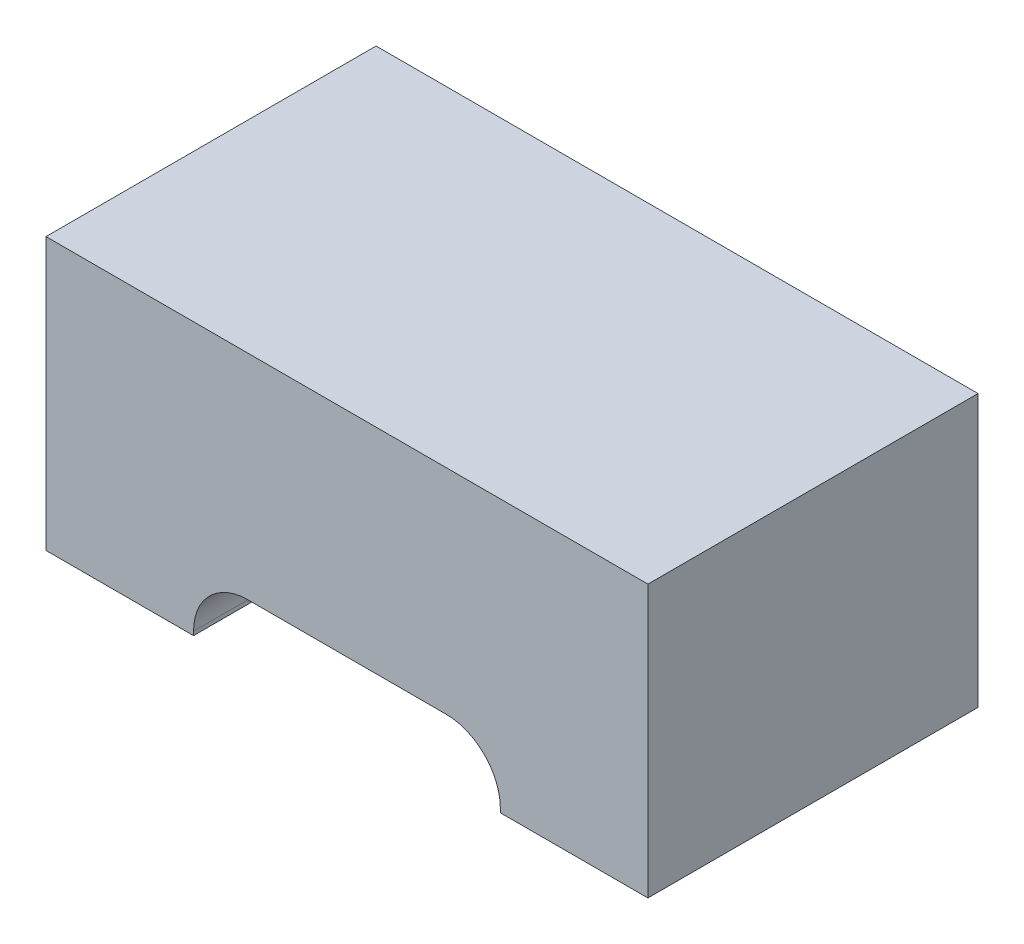
ISO-10303-21;
HEADER;
FILE_DESCRIPTION(('STEP AP214'),'2;1');
FILE_NAME('part.step','',(''),(''),'','','');
FILE_SCHEMA(('AUTOMOTIVE_DESIGN { 1 0 10303 214 1 1 1 1 }'));
ENDSEC;
DATA;
#1=APPLICATION_CONTEXT('core data for automotive mechanical design processes');
#2=APPLICATION_PROTOCOL_DEFINITION('international standard','automotive_design',2000,#1);
#3=PRODUCT_CONTEXT('',#1,'mechanical');
#4=PRODUCT('Part','Part','',(#3));
#5=PRODUCT_RELATED_PRODUCT_CATEGORY('part','',(#4));
#6=PRODUCT_DEFINITION_FORMATION('','',#4);
#7=PRODUCT_DEFINITION_CONTEXT('part definition',#1,'design');
#8=PRODUCT_DEFINITION('design','',#6,#7);
#9=PRODUCT_DEFINITION_SHAPE('','',#8);
#10=(LENGTH_UNIT() NAMED_UNIT(*) SI_UNIT(.MILLI.,.METRE.));
#11=(NAMED_UNIT(*) PLANE_ANGLE_UNIT() SI_UNIT($,.RADIAN.));
#12=(NAMED_UNIT(*) SI_UNIT($,.STERADIAN.) SOLID_ANGLE_UNIT());
#13=UNCERTAINTY_MEASURE_WITH_UNIT(LENGTH_MEASURE(1.E-05),#10,'distance_accuracy_value','');
#14=(GEOMETRIC_REPRESENTATION_CONTEXT(3) GLOBAL_UNCERTAINTY_ASSIGNED_CONTEXT((#13)) GLOBAL_UNIT_ASSIGNED_CONTEXT((#10,
#11,#12)) REPRESENTATION_CONTEXT('',''));
#15=CARTESIAN_POINT('',(0.,0.,0.));
#16=DIRECTION('',(0.,0.,1.));
#17=DIRECTION('',(1.,0.,0.));
#18=AXIS2_PLACEMENT_3D('',#15,#16,#17);
#19=CARTESIAN_POINT('',(0.,0.,0.));
#20=DIRECTION('',(0.,-1.,0.));
#21=DIRECTION('',(0.,0.,-1.));
#22=AXIS2_PLACEMENT_3D('',#19,#20,#21);
#23=PLANE('',#22);
#24=DIRECTION('',(0.,0.,1.));
#25=VECTOR('',#24,1.);
#26=CARTESIAN_POINT('',(0.395,0.,-0.425));
#27=LINE('',#26,#25);
#28=CARTESIAN_POINT('',(0.395,0.,-0.425));
#29=VERTEX_POINT('',#28);
#30=CARTESIAN_POINT('',(0.395,0.,0.425));
#31=VERTEX_POINT('',#30);
#32=EDGE_CURVE('E137',#29,#31,#27,.T.);
#33=ORIENTED_EDGE('',*,*,#32,.F.);
#34=DIRECTION('',(-1.,0.,0.));
#35=VECTOR('',#34,1.);
#36=CARTESIAN_POINT('',(-0.775,0.,-0.425));
#37=LINE('',#36,#35);
#38=CARTESIAN_POINT('',(0.775,0.,-0.425));
#39=VERTEX_POINT('',#38);
#40=EDGE_CURVE('E181',#39,#29,#37,.T.);
#41=ORIENTED_EDGE('',*,*,#40,.F.);
#42=DIRECTION('',(0.,0.,-1.));
#43=VECTOR('',#42,1.);
#44=CARTESIAN_POINT('',(0.775,0.,0.425));
#45=LINE('',#44,#43);
#46=CARTESIAN_POINT('',(0.775,0.,0.425));
#47=VERTEX_POINT('',#46);
#48=EDGE_CURVE('E162',#47,#39,#45,.T.);
#49=ORIENTED_EDGE('',*,*,#48,.F.);
#50=DIRECTION('',(1.,0.,0.));
#51=VECTOR('',#50,1.);
#52=CARTESIAN_POINT('',(-0.775,0.,0.425));
#53=LINE('',#52,#51);
#54=EDGE_CURVE('E80',#31,#47,#53,.T.);
#55=ORIENTED_EDGE('',*,*,#54,.F.);
#56=EDGE_LOOP('',(#33,#41,#49,#55));
#57=FACE_BOUND('',#56,.T.);
#58=ADVANCED_FACE('F35',(#57),#23,.T.);
#59=CARTESIAN_POINT('',(0.775,0.7,0.425));
#60=DIRECTION('',(-1.,0.,0.));
#61=DIRECTION('',(0.,0.,1.));
#62=AXIS2_PLACEMENT_3D('',#59,#60,#61);
#63=PLANE('',#62);
#64=ORIENTED_EDGE('',*,*,#48,.T.);
#65=DIRECTION('',(0.,-1.,0.));
#66=VECTOR('',#65,1.);
#67=CARTESIAN_POINT('',(0.775,0.7,-0.425));
#68=LINE('',#67,#66);
#69=CARTESIAN_POINT('',(0.775,0.7,-0.425));
#70=VERTEX_POINT('',#69);
#71=EDGE_CURVE('E11',#70,#39,#68,.T.);
#72=ORIENTED_EDGE('',*,*,#71,.F.);
#73=DIRECTION('',(0.,0.,-1.));
#74=VECTOR('',#73,1.);
#75=CARTESIAN_POINT('',(0.775,0.7,0.425));
#76=LINE('',#75,#74);
#77=CARTESIAN_POINT('',(0.775,0.7,0.425));
#78=VERTEX_POINT('',#77);
#79=EDGE_CURVE('E170',#78,#70,#76,.T.);
#80=ORIENTED_EDGE('',*,*,#79,.F.);
#81=DIRECTION('',(0.,-1.,0.));
#82=VECTOR('',#81,1.);
#83=CARTESIAN_POINT('',(0.775,0.7,0.425));
#84=LINE('',#83,#82);
#85=EDGE_CURVE('E177',#78,#47,#84,.T.);
#86=ORIENTED_EDGE('',*,*,#85,.T.);
#87=EDGE_LOOP('',(#64,#72,#80,#86));
#88=FACE_BOUND('',#87,.T.);
#89=ADVANCED_FACE('F37',(#88),#63,.F.);
#90=CARTESIAN_POINT('',(-0.775,0.7,-0.425));
#91=DIRECTION('',(0.,0.,1.));
#92=DIRECTION('',(1.,0.,0.));
#93=AXIS2_PLACEMENT_3D('',#90,#91,#92);
#94=PLANE('',#93);
#95=ORIENTED_EDGE('',*,*,#40,.T.);
#96=DIRECTION('',(0.,1.,0.));
#97=VECTOR('',#96,1.);
#98=CARTESIAN_POINT('',(0.395,0.00999999999999897,-0.425));
#99=LINE('',#98,#97);
#100=CARTESIAN_POINT('',(0.395,0.00999999999999902,-0.425));
#101=VERTEX_POINT('',#100);
#102=EDGE_CURVE('E150',#29,#101,#99,.T.);
#103=ORIENTED_EDGE('',*,*,#102,.T.);
#104=CARTESIAN_POINT('',(0.255,0.01,-0.425));
#105=DIRECTION('',(0.,0.,1.));
#106=DIRECTION('',(-1.,0.,0.));
#107=AXIS2_PLACEMENT_3D('',#104,#105,#106);
#108=CIRCLE('',#107,0.14);
#109=CARTESIAN_POINT('',(0.254999999999999,0.15,-0.425));
#110=VERTEX_POINT('',#109);
#111=EDGE_CURVE('E128',#101,#110,#108,.T.);
#112=ORIENTED_EDGE('',*,*,#111,.T.);
#113=DIRECTION('',(-1.,0.,0.));
#114=VECTOR('',#113,1.);
#115=CARTESIAN_POINT('',(-0.254999999999999,0.15,-0.425));
#116=LINE('',#115,#114);
#117=CARTESIAN_POINT('',(-0.254999999999999,0.15,-0.425));
#118=VERTEX_POINT('',#117);
#119=EDGE_CURVE('E153',#110,#118,#116,.T.);
#120=ORIENTED_EDGE('',*,*,#119,.T.);
#121=CARTESIAN_POINT('',(-0.255,0.00999999999999997,-0.425));
#122=DIRECTION('',(0.,0.,1.));
#123=DIRECTION('',(1.,0.,0.));
#124=AXIS2_PLACEMENT_3D('',#121,#122,#123);
#125=CIRCLE('',#124,0.14);
#126=CARTESIAN_POINT('',(-0.395,0.00999999999999894,-0.425));
#127=VERTEX_POINT('',#126);
#128=EDGE_CURVE('E156',#118,#127,#125,.T.);
#129=ORIENTED_EDGE('',*,*,#128,.T.);
#130=DIRECTION('',(0.,-1.,0.));
#131=VECTOR('',#130,1.);
#132=CARTESIAN_POINT('',(-0.395,0.00999999999999894,-0.425));
#133=LINE('',#132,#131);
#134=CARTESIAN_POINT('',(-0.395,0.,-0.425));
#135=VERTEX_POINT('',#134);
#136=EDGE_CURVE('E132',#127,#135,#133,.T.);
#137=ORIENTED_EDGE('',*,*,#136,.T.);
#138=CARTESIAN_POINT('',(-0.775,0.,-0.425));
#139=VERTEX_POINT('',#138);
#140=EDGE_CURVE('E180',#135,#139,#37,.T.);
#141=ORIENTED_EDGE('',*,*,#140,.T.);
#142=DIRECTION('',(0.,-1.,0.));
#143=VECTOR('',#142,1.);
#144=CARTESIAN_POINT('',(-0.775,0.7,-0.425));
#145=LINE('',#144,#143);
#146=CARTESIAN_POINT('',(-0.775,0.7,-0.425));
#147=VERTEX_POINT('',#146);
#148=EDGE_CURVE('E43',#147,#139,#145,.T.);
#149=ORIENTED_EDGE('',*,*,#148,.F.);
#150=DIRECTION('',(-1.,0.,0.));
#151=VECTOR('',#150,1.);
#152=CARTESIAN_POINT('',(-0.775,0.7,-0.425));
#153=LINE('',#152,#151);
#154=EDGE_CURVE('E87',#70,#147,#153,.T.);
#155=ORIENTED_EDGE('',*,*,#154,.F.);
#156=ORIENTED_EDGE('',*,*,#71,.T.);
#157=EDGE_LOOP('',(#95,#103,#112,#120,#129,#137,#141,#149,#155,#156));
#158=FACE_BOUND('',#157,.T.);
#159=ADVANCED_FACE('F220',(#158),#94,.F.);
#160=CARTESIAN_POINT('',(-0.775,0.7,0.425));
#161=DIRECTION('',(1.,0.,0.));
#162=DIRECTION('',(0.,0.,-1.));
#163=AXIS2_PLACEMENT_3D('',#160,#161,#162);
#164=PLANE('',#163);
#165=DIRECTION('',(0.,0.,1.));
#166=VECTOR('',#165,1.);
#167=CARTESIAN_POINT('',(-0.775,0.,0.425));
#168=LINE('',#167,#166);
#169=CARTESIAN_POINT('',(-0.775,0.,0.425));
#170=VERTEX_POINT('',#169);
#171=EDGE_CURVE('E184',#139,#170,#168,.T.);
#172=ORIENTED_EDGE('',*,*,#171,.T.);
#173=DIRECTION('',(0.,-1.,0.));
#174=VECTOR('',#173,1.);
#175=CARTESIAN_POINT('',(-0.775,0.7,0.425));
#176=LINE('',#175,#174);
#177=CARTESIAN_POINT('',(-0.775,0.7,0.425));
#178=VERTEX_POINT('',#177);
#179=EDGE_CURVE('E189',#178,#170,#176,.T.);
#180=ORIENTED_EDGE('',*,*,#179,.F.);
#181=DIRECTION('',(0.,0.,1.));
#182=VECTOR('',#181,1.);
#183=CARTESIAN_POINT('',(-0.775,0.7,0.425));
#184=LINE('',#183,#182);
#185=EDGE_CURVE('E174',#147,#178,#184,.T.);
#186=ORIENTED_EDGE('',*,*,#185,.F.);
#187=ORIENTED_EDGE('',*,*,#148,.T.);
#188=EDGE_LOOP('',(#172,#180,#186,#187));
#189=FACE_BOUND('',#188,.T.);
#190=ADVANCED_FACE('F195',(#189),#164,.F.);
#191=CARTESIAN_POINT('',(-0.775,0.7,0.425));
#192=DIRECTION('',(0.,0.,-1.));
#193=DIRECTION('',(-1.,0.,0.));
#194=AXIS2_PLACEMENT_3D('',#191,#192,#193);
#195=PLANE('',#194);
#196=CARTESIAN_POINT('',(0.255,0.01,0.425));
#197=DIRECTION('',(0.,0.,1.));
#198=DIRECTION('',(-1.,0.,0.));
#199=AXIS2_PLACEMENT_3D('',#196,#197,#198);
#200=CIRCLE('',#199,0.14);
#201=CARTESIAN_POINT('',(0.395,0.00999999999999902,0.425));
#202=VERTEX_POINT('',#201);
#203=CARTESIAN_POINT('',(0.254999999999999,0.15,0.425));
#204=VERTEX_POINT('',#203);
#205=EDGE_CURVE('E125',#202,#204,#200,.T.);
#206=ORIENTED_EDGE('',*,*,#205,.F.);
#207=DIRECTION('',(0.,1.,0.));
#208=VECTOR('',#207,1.);
#209=CARTESIAN_POINT('',(0.395,0.00999999999999897,0.425));
#210=LINE('',#209,#208);
#211=EDGE_CURVE('E134',#31,#202,#210,.T.);
#212=ORIENTED_EDGE('',*,*,#211,.F.);
#213=ORIENTED_EDGE('',*,*,#54,.T.);
#214=ORIENTED_EDGE('',*,*,#85,.F.);
#215=DIRECTION('',(1.,0.,0.));
#216=VECTOR('',#215,1.);
#217=CARTESIAN_POINT('',(-0.775,0.7,0.425));
#218=LINE('',#217,#216);
#219=EDGE_CURVE('E59',#178,#78,#218,.T.);
#220=ORIENTED_EDGE('',*,*,#219,.F.);
#221=ORIENTED_EDGE('',*,*,#179,.T.);
#222=CARTESIAN_POINT('',(-0.395,0.,0.425));
#223=VERTEX_POINT('',#222);
#224=EDGE_CURVE('E172',#170,#223,#53,.T.);
#225=ORIENTED_EDGE('',*,*,#224,.T.);
#226=DIRECTION('',(0.,-1.,0.));
#227=VECTOR('',#226,1.);
#228=CARTESIAN_POINT('',(-0.395,0.00999999999999894,0.425));
#229=LINE('',#228,#227);
#230=CARTESIAN_POINT('',(-0.395,0.00999999999999894,0.425));
#231=VERTEX_POINT('',#230);
#232=EDGE_CURVE('E50',#231,#223,#229,.T.);
#233=ORIENTED_EDGE('',*,*,#232,.F.);
#234=CARTESIAN_POINT('',(-0.255,0.00999999999999997,0.425));
#235=DIRECTION('',(0.,0.,1.));
#236=DIRECTION('',(1.,0.,0.));
#237=AXIS2_PLACEMENT_3D('',#234,#235,#236);
#238=CIRCLE('',#237,0.14);
#239=CARTESIAN_POINT('',(-0.254999999999999,0.15,0.425));
#240=VERTEX_POINT('',#239);
#241=EDGE_CURVE('E144',#240,#231,#238,.T.);
#242=ORIENTED_EDGE('',*,*,#241,.F.);
#243=DIRECTION('',(-1.,0.,0.));
#244=VECTOR('',#243,1.);
#245=CARTESIAN_POINT('',(-0.254999999999999,0.15,0.425));
#246=LINE('',#245,#244);
#247=EDGE_CURVE('E142',#204,#240,#246,.T.);
#248=ORIENTED_EDGE('',*,*,#247,.F.);
#249=EDGE_LOOP('',(#206,#212,#213,#214,#220,#221,#225,#233,#242,#248));
#250=FACE_BOUND('',#249,.T.);
#251=ADVANCED_FACE('F139',(#250),#195,.F.);
#252=CARTESIAN_POINT('',(0.,0.7,0.));
#253=DIRECTION('',(0.,-1.,0.));
#254=DIRECTION('',(0.,0.,-1.));
#255=AXIS2_PLACEMENT_3D('',#252,#253,#254);
#256=PLANE('',#255);
#257=ORIENTED_EDGE('',*,*,#79,.T.);
#258=ORIENTED_EDGE('',*,*,#154,.T.);
#259=ORIENTED_EDGE('',*,*,#185,.T.);
#260=ORIENTED_EDGE('',*,*,#219,.T.);
#261=EDGE_LOOP('',(#257,#258,#259,#260));
#262=FACE_BOUND('',#261,.T.);
#263=ADVANCED_FACE('F205',(#262),#256,.F.);
#264=DIRECTION('',(0.,0.,1.));
#265=VECTOR('',#264,1.);
#266=CARTESIAN_POINT('',(-0.395,0.,-0.425));
#267=LINE('',#266,#265);
#268=EDGE_CURVE('E163',#135,#223,#267,.T.);
#269=ORIENTED_EDGE('',*,*,#268,.T.);
#270=ORIENTED_EDGE('',*,*,#224,.F.);
#271=ORIENTED_EDGE('',*,*,#171,.F.);
#272=ORIENTED_EDGE('',*,*,#140,.F.);
#273=EDGE_LOOP('',(#269,#270,#271,#272));
#274=FACE_BOUND('',#273,.T.);
#275=ADVANCED_FACE('F200',(#274),#23,.T.);
#276=CARTESIAN_POINT('',(0.395,0.00999999999999897,-0.425));
#277=DIRECTION('',(1.,0.,0.));
#278=DIRECTION('',(0.,0.,-1.));
#279=AXIS2_PLACEMENT_3D('',#276,#277,#278);
#280=PLANE('',#279);
#281=DIRECTION('',(0.,0.,1.));
#282=VECTOR('',#281,1.);
#283=CARTESIAN_POINT('',(0.395,0.00999999999999902,-0.425));
#284=LINE('',#283,#282);
#285=EDGE_CURVE('E121',#101,#202,#284,.T.);
#286=ORIENTED_EDGE('',*,*,#285,.F.);
#287=ORIENTED_EDGE('',*,*,#102,.F.);
#288=ORIENTED_EDGE('',*,*,#32,.T.);
#289=ORIENTED_EDGE('',*,*,#211,.T.);
#290=EDGE_LOOP('',(#286,#287,#288,#289));
#291=FACE_BOUND('',#290,.T.);
#292=ADVANCED_FACE('F135',(#291),#280,.F.);
#293=CARTESIAN_POINT('',(-0.395,0.00999999999999894,-0.425));
#294=DIRECTION('',(-1.,0.,0.));
#295=DIRECTION('',(0.,0.,1.));
#296=AXIS2_PLACEMENT_3D('',#293,#294,#295);
#297=PLANE('',#296);
#298=ORIENTED_EDGE('',*,*,#268,.F.);
#299=ORIENTED_EDGE('',*,*,#136,.F.);
#300=DIRECTION('',(0.,0.,1.));
#301=VECTOR('',#300,1.);
#302=CARTESIAN_POINT('',(-0.395,0.00999999999999894,-0.425));
#303=LINE('',#302,#301);
#304=EDGE_CURVE('E165',#127,#231,#303,.T.);
#305=ORIENTED_EDGE('',*,*,#304,.T.);
#306=ORIENTED_EDGE('',*,*,#232,.T.);
#307=EDGE_LOOP('',(#298,#299,#305,#306));
#308=FACE_BOUND('',#307,.T.);
#309=ADVANCED_FACE('F233',(#308),#297,.F.);
#310=CARTESIAN_POINT('',(-0.255,0.00999999999999997,-0.425));
#311=DIRECTION('',(0.,0.,1.));
#312=DIRECTION('',(1.,0.,0.));
#313=AXIS2_PLACEMENT_3D('',#310,#311,#312);
#314=CYLINDRICAL_SURFACE('',#313,0.14);
#315=ORIENTED_EDGE('',*,*,#304,.F.);
#316=ORIENTED_EDGE('',*,*,#128,.F.);
#317=DIRECTION('',(0.,0.,1.));
#318=VECTOR('',#317,1.);
#319=CARTESIAN_POINT('',(-0.254999999999999,0.15,-0.425));
#320=LINE('',#319,#318);
#321=EDGE_CURVE('E167',#118,#240,#320,.T.);
#322=ORIENTED_EDGE('',*,*,#321,.T.);
#323=ORIENTED_EDGE('',*,*,#241,.T.);
#324=EDGE_LOOP('',(#315,#316,#322,#323));
#325=FACE_BOUND('',#324,.T.);
#326=ADVANCED_FACE('F231',(#325),#314,.F.);
#327=CARTESIAN_POINT('',(-0.254999999999999,0.15,-0.425));
#328=DIRECTION('',(0.,1.,0.));
#329=DIRECTION('',(-1.,0.,0.));
#330=AXIS2_PLACEMENT_3D('',#327,#328,#329);
#331=PLANE('',#330);
#332=ORIENTED_EDGE('',*,*,#321,.F.);
#333=ORIENTED_EDGE('',*,*,#119,.F.);
#334=DIRECTION('',(0.,0.,1.));
#335=VECTOR('',#334,1.);
#336=CARTESIAN_POINT('',(0.254999999999999,0.15,-0.425));
#337=LINE('',#336,#335);
#338=EDGE_CURVE('E131',#110,#204,#337,.T.);
#339=ORIENTED_EDGE('',*,*,#338,.T.);
#340=ORIENTED_EDGE('',*,*,#247,.T.);
#341=EDGE_LOOP('',(#332,#333,#339,#340));
#342=FACE_BOUND('',#341,.T.);
#343=ADVANCED_FACE('F229',(#342),#331,.F.);
#344=CARTESIAN_POINT('',(0.255,0.01,-0.425));
#345=DIRECTION('',(0.,0.,1.));
#346=DIRECTION('',(1.,0.,0.));
#347=AXIS2_PLACEMENT_3D('',#344,#345,#346);
#348=CYLINDRICAL_SURFACE('',#347,0.14);
#349=ORIENTED_EDGE('',*,*,#338,.F.);
#350=ORIENTED_EDGE('',*,*,#111,.F.);
#351=ORIENTED_EDGE('',*,*,#285,.T.);
#352=ORIENTED_EDGE('',*,*,#205,.T.);
#353=EDGE_LOOP('',(#349,#350,#351,#352));
#354=FACE_BOUND('',#353,.T.);
#355=ADVANCED_FACE('F123',(#354),#348,.F.);
#356=CLOSED_SHELL('',(#58,#89,#159,#190,#251,#263,#275,#292,#309,#326,#343,#355));
#357=MANIFOLD_SOLID_BREP('B2',#356);
#358=ADVANCED_BREP_SHAPE_REPRESENTATION('',(#18,#357),#14);
#359=SHAPE_DEFINITION_REPRESENTATION(#9,#358);
ENDSEC;
END-ISO-10303-21;
